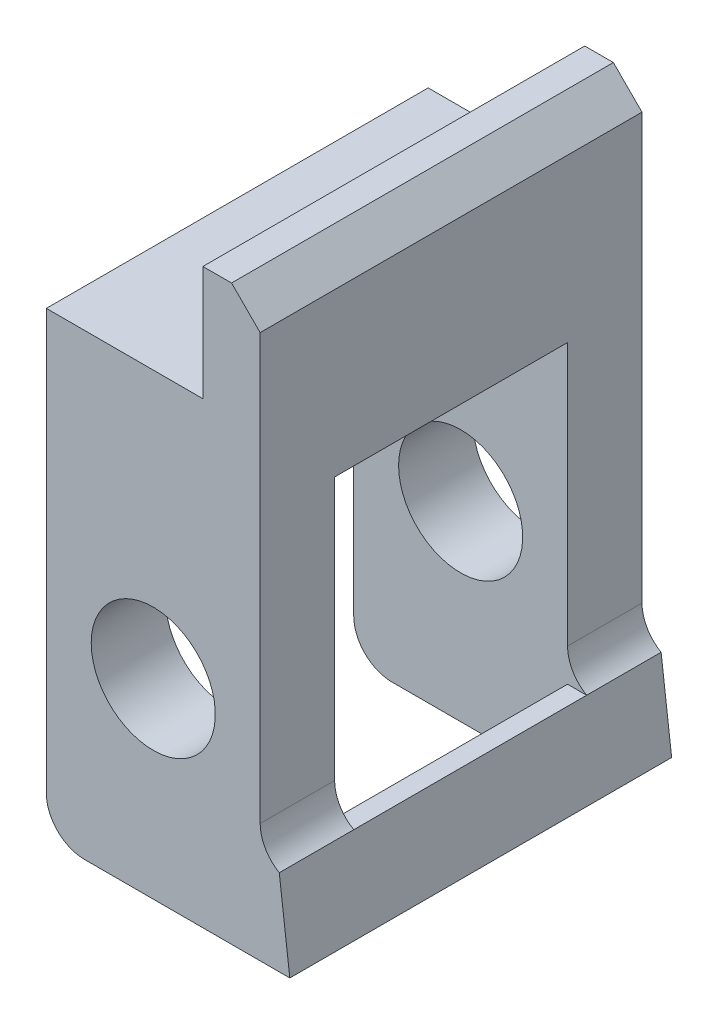
ISO-10303-21;
HEADER;
FILE_DESCRIPTION(('STEP AP214'),'2;1');
FILE_NAME('part.step','',(''),(''),'','','');
FILE_SCHEMA(('AUTOMOTIVE_DESIGN { 1 0 10303 214 1 1 1 1 }'));
ENDSEC;
DATA;
#1=APPLICATION_CONTEXT('core data for automotive mechanical design processes');
#2=APPLICATION_PROTOCOL_DEFINITION('international standard','automotive_design',2000,#1);
#3=PRODUCT_CONTEXT('',#1,'mechanical');
#4=PRODUCT('Part','Part','',(#3));
#5=PRODUCT_RELATED_PRODUCT_CATEGORY('part','',(#4));
#6=PRODUCT_DEFINITION_FORMATION('','',#4);
#7=PRODUCT_DEFINITION_CONTEXT('part definition',#1,'design');
#8=PRODUCT_DEFINITION('design','',#6,#7);
#9=PRODUCT_DEFINITION_SHAPE('','',#8);
#10=(LENGTH_UNIT() NAMED_UNIT(*) SI_UNIT(.MILLI.,.METRE.));
#11=(NAMED_UNIT(*) PLANE_ANGLE_UNIT() SI_UNIT($,.RADIAN.));
#12=(NAMED_UNIT(*) SI_UNIT($,.STERADIAN.) SOLID_ANGLE_UNIT());
#13=UNCERTAINTY_MEASURE_WITH_UNIT(LENGTH_MEASURE(1.E-05),#10,'distance_accuracy_value','');
#14=(GEOMETRIC_REPRESENTATION_CONTEXT(3) GLOBAL_UNCERTAINTY_ASSIGNED_CONTEXT((#13)) GLOBAL_UNIT_ASSIGNED_CONTEXT((#10,
#11,#12)) REPRESENTATION_CONTEXT('',''));
#15=CARTESIAN_POINT('',(0.,0.,0.));
#16=DIRECTION('',(0.,0.,1.));
#17=DIRECTION('',(1.,0.,0.));
#18=AXIS2_PLACEMENT_3D('',#15,#16,#17);
#19=CARTESIAN_POINT('',(11.684,5.71500000000001,32.6812626722529));
#20=DIRECTION('',(0.,1.,0.));
#21=DIRECTION('',(-1.,0.,0.));
#22=AXIS2_PLACEMENT_3D('',#19,#20,#21);
#23=PLANE('',#22);
#24=DIRECTION('',(1.,0.,0.));
#25=VECTOR('',#24,1.);
#26=CARTESIAN_POINT('',(25.4,5.71499999999999,4.953));
#27=LINE('',#26,#25);
#28=CARTESIAN_POINT('',(14.224,5.71500000000001,4.953));
#29=VERTEX_POINT('',#28);
#30=CARTESIAN_POINT('',(15.494,5.715,4.953));
#31=VERTEX_POINT('',#30);
#32=EDGE_CURVE('E55',#29,#31,#27,.T.);
#33=ORIENTED_EDGE('',*,*,#32,.F.);
#34=DIRECTION('',(0.,0.,-1.));
#35=VECTOR('',#34,1.);
#36=CARTESIAN_POINT('',(14.224,5.71500000000001,27.0173830282429));
#37=LINE('',#36,#35);
#38=CARTESIAN_POINT('',(14.224,5.71500000000001,20.447));
#39=VERTEX_POINT('',#38);
#40=EDGE_CURVE('E297',#39,#29,#37,.T.);
#41=ORIENTED_EDGE('',*,*,#40,.F.);
#42=DIRECTION('',(-1.,0.,0.));
#43=VECTOR('',#42,1.);
#44=CARTESIAN_POINT('',(25.4,5.71499999999999,20.447));
#45=LINE('',#44,#43);
#46=CARTESIAN_POINT('',(15.494,5.715,20.447));
#47=VERTEX_POINT('',#46);
#48=EDGE_CURVE('E63',#47,#39,#45,.T.);
#49=ORIENTED_EDGE('',*,*,#48,.F.);
#50=DIRECTION('',(0.,0.,-1.));
#51=VECTOR('',#50,1.);
#52=CARTESIAN_POINT('',(15.494,5.715,32.6812626722529));
#53=LINE('',#52,#51);
#54=EDGE_CURVE('E283',#47,#31,#53,.T.);
#55=ORIENTED_EDGE('',*,*,#54,.T.);
#56=EDGE_LOOP('',(#33,#41,#49,#55));
#57=FACE_BOUND('',#56,.T.);
#58=ADVANCED_FACE('F41',(#57),#23,.T.);
#59=CARTESIAN_POINT('',(2.54,2.54,25.4));
#60=DIRECTION('',(0.,0.,-1.));
#61=DIRECTION('',(-1.,0.,0.));
#62=AXIS2_PLACEMENT_3D('',#59,#60,#61);
#63=CYLINDRICAL_SURFACE('',#62,2.54);
#64=CARTESIAN_POINT('',(2.54,2.54,4.953));
#65=DIRECTION('',(0.,0.,-1.));
#66=DIRECTION('',(0.,1.,0.));
#67=AXIS2_PLACEMENT_3D('',#64,#65,#66);
#68=CIRCLE('',#67,2.54);
#69=CARTESIAN_POINT('',(0.,2.54,4.953));
#70=VERTEX_POINT('',#69);
#71=CARTESIAN_POINT('',(2.54,0.,4.953));
#72=VERTEX_POINT('',#71);
#73=EDGE_CURVE('E327',#70,#72,#68,.F.);
#74=ORIENTED_EDGE('',*,*,#73,.F.);
#75=DIRECTION('',(0.,0.,-1.));
#76=VECTOR('',#75,1.);
#77=CARTESIAN_POINT('',(0.,2.54,25.4));
#78=LINE('',#77,#76);
#79=CARTESIAN_POINT('',(0.,2.54,0.));
#80=VERTEX_POINT('',#79);
#81=EDGE_CURVE('E222',#80,#70,#78,.F.);
#82=ORIENTED_EDGE('',*,*,#81,.F.);
#83=CARTESIAN_POINT('',(2.54,2.54,0.));
#84=DIRECTION('',(0.,0.,-1.));
#85=DIRECTION('',(-1.,0.,0.));
#86=AXIS2_PLACEMENT_3D('',#83,#84,#85);
#87=CIRCLE('',#86,2.54);
#88=CARTESIAN_POINT('',(2.54,0.,0.));
#89=VERTEX_POINT('',#88);
#90=EDGE_CURVE('E219',#89,#80,#87,.T.);
#91=ORIENTED_EDGE('',*,*,#90,.F.);
#92=DIRECTION('',(0.,0.,-1.));
#93=VECTOR('',#92,1.);
#94=CARTESIAN_POINT('',(2.54,0.,25.4));
#95=LINE('',#94,#93);
#96=EDGE_CURVE('E215',#72,#89,#95,.T.);
#97=ORIENTED_EDGE('',*,*,#96,.F.);
#98=EDGE_LOOP('',(#74,#82,#91,#97));
#99=FACE_BOUND('',#98,.T.);
#100=ADVANCED_FACE('F354',(#99),#63,.T.);
#101=CARTESIAN_POINT('',(7.112,12.7,25.4));
#102=DIRECTION('',(0.,0.,-1.));
#103=DIRECTION('',(-1.,0.,0.));
#104=AXIS2_PLACEMENT_3D('',#101,#102,#103);
#105=CYLINDRICAL_SURFACE('',#104,4.1275);
#106=CARTESIAN_POINT('',(7.112,12.7,4.953));
#107=DIRECTION('',(0.,0.,-1.));
#108=DIRECTION('',(0.,1.,0.));
#109=AXIS2_PLACEMENT_3D('',#106,#107,#108);
#110=CIRCLE('',#109,4.1275);
#111=CARTESIAN_POINT('',(7.112,16.8275,4.953));
#112=VERTEX_POINT('',#111);
#113=EDGE_CURVE('E236',#112,#112,#110,.F.);
#114=ORIENTED_EDGE('',*,*,#113,.T.);
#115=EDGE_LOOP('',(#114));
#116=FACE_BOUND('',#115,.T.);
#117=CARTESIAN_POINT('',(7.112,12.7,0.));
#118=DIRECTION('',(0.,0.,-1.));
#119=DIRECTION('',(-1.,0.,0.));
#120=AXIS2_PLACEMENT_3D('',#117,#118,#119);
#121=CIRCLE('',#120,4.1275);
#122=CARTESIAN_POINT('',(2.9845,12.7,0.));
#123=VERTEX_POINT('',#122);
#124=EDGE_CURVE('E203',#123,#123,#121,.T.);
#125=ORIENTED_EDGE('',*,*,#124,.T.);
#126=EDGE_LOOP('',(#125));
#127=FACE_BOUND('',#126,.T.);
#128=ADVANCED_FACE('F389',(#116,#127),#105,.F.);
#129=CARTESIAN_POINT('',(14.224,0.,25.4));
#130=DIRECTION('',(0.,1.,0.));
#131=DIRECTION('',(-1.,0.,0.));
#132=AXIS2_PLACEMENT_3D('',#129,#130,#131);
#133=PLANE('',#132);
#134=DIRECTION('',(0.,0.,-1.));
#135=VECTOR('',#134,1.);
#136=CARTESIAN_POINT('',(14.9257137655601,0.,27.0173830282429));
#137=LINE('',#136,#135);
#138=CARTESIAN_POINT('',(14.9257137655601,0.,20.447));
#139=VERTEX_POINT('',#138);
#140=CARTESIAN_POINT('',(14.9257137655601,0.,4.953));
#141=VERTEX_POINT('',#140);
#142=EDGE_CURVE('E187',#139,#141,#137,.T.);
#143=ORIENTED_EDGE('',*,*,#142,.T.);
#144=DIRECTION('',(-1.,0.,0.));
#145=VECTOR('',#144,1.);
#146=CARTESIAN_POINT('',(25.4,0.,4.953));
#147=LINE('',#146,#145);
#148=EDGE_CURVE('E304',#141,#72,#147,.T.);
#149=ORIENTED_EDGE('',*,*,#148,.T.);
#150=ORIENTED_EDGE('',*,*,#96,.T.);
#151=DIRECTION('',(1.,0.,0.));
#152=VECTOR('',#151,1.);
#153=CARTESIAN_POINT('',(14.224,0.,0.));
#154=LINE('',#153,#152);
#155=CARTESIAN_POINT('',(16.1957137655601,0.,0.));
#156=VERTEX_POINT('',#155);
#157=EDGE_CURVE('E200',#89,#156,#154,.T.);
#158=ORIENTED_EDGE('',*,*,#157,.T.);
#159=DIRECTION('',(0.,0.,-1.));
#160=VECTOR('',#159,1.);
#161=CARTESIAN_POINT('',(16.1957137655601,0.,32.6812626722529));
#162=LINE('',#161,#160);
#163=CARTESIAN_POINT('',(16.1957137655601,0.,25.4));
#164=VERTEX_POINT('',#163);
#165=EDGE_CURVE('E279',#164,#156,#162,.T.);
#166=ORIENTED_EDGE('',*,*,#165,.F.);
#167=DIRECTION('',(1.,0.,0.));
#168=VECTOR('',#167,1.);
#169=CARTESIAN_POINT('',(14.224,0.,25.4));
#170=LINE('',#169,#168);
#171=CARTESIAN_POINT('',(2.54,0.,25.4));
#172=VERTEX_POINT('',#171);
#173=EDGE_CURVE('E211',#172,#164,#170,.T.);
#174=ORIENTED_EDGE('',*,*,#173,.F.);
#175=CARTESIAN_POINT('',(2.54,0.,20.447));
#176=VERTEX_POINT('',#175);
#177=EDGE_CURVE('E216',#172,#176,#95,.T.);
#178=ORIENTED_EDGE('',*,*,#177,.T.);
#179=DIRECTION('',(-1.,0.,0.));
#180=VECTOR('',#179,1.);
#181=CARTESIAN_POINT('',(25.4,0.,20.447));
#182=LINE('',#181,#180);
#183=EDGE_CURVE('E320',#139,#176,#182,.T.);
#184=ORIENTED_EDGE('',*,*,#183,.F.);
#185=EDGE_LOOP('',(#143,#149,#150,#158,#166,#174,#178,#184));
#186=FACE_BOUND('',#185,.T.);
#187=ADVANCED_FACE('F357',(#186),#133,.F.);
#188=CARTESIAN_POINT('',(14.224,38.1,25.4));
#189=DIRECTION('',(-1.,0.,0.));
#190=DIRECTION('',(0.,-1.,0.));
#191=AXIS2_PLACEMENT_3D('',#188,#189,#190);
#192=PLANE('',#191);
#193=DIRECTION('',(0.,1.,0.));
#194=VECTOR('',#193,1.);
#195=CARTESIAN_POINT('',(14.224,38.1,25.4));
#196=LINE('',#195,#194);
#197=CARTESIAN_POINT('',(14.224,7.91470452561248,25.4));
#198=VERTEX_POINT('',#197);
#199=CARTESIAN_POINT('',(14.224,36.195,25.4));
#200=VERTEX_POINT('',#199);
#201=EDGE_CURVE('E335',#198,#200,#196,.T.);
#202=ORIENTED_EDGE('',*,*,#201,.F.);
#203=DIRECTION('',(0.,0.,-1.));
#204=VECTOR('',#203,1.);
#205=CARTESIAN_POINT('',(14.224,7.91470452561247,25.4));
#206=LINE('',#205,#204);
#207=CARTESIAN_POINT('',(14.224,7.91470452561247,20.447));
#208=VERTEX_POINT('',#207);
#209=EDGE_CURVE('E255',#198,#208,#206,.T.);
#210=ORIENTED_EDGE('',*,*,#209,.T.);
#211=DIRECTION('',(0.,1.,0.));
#212=VECTOR('',#211,1.);
#213=CARTESIAN_POINT('',(14.224,38.1,20.447));
#214=LINE('',#213,#212);
#215=CARTESIAN_POINT('',(14.224,25.4,20.447));
#216=VERTEX_POINT('',#215);
#217=EDGE_CURVE('E234',#208,#216,#214,.T.);
#218=ORIENTED_EDGE('',*,*,#217,.T.);
#219=DIRECTION('',(0.,0.,-1.));
#220=VECTOR('',#219,1.);
#221=CARTESIAN_POINT('',(14.224,25.4,25.4));
#222=LINE('',#221,#220);
#223=CARTESIAN_POINT('',(14.224,25.4,4.953));
#224=VERTEX_POINT('',#223);
#225=EDGE_CURVE('E329',#216,#224,#222,.T.);
#226=ORIENTED_EDGE('',*,*,#225,.T.);
#227=DIRECTION('',(0.,-1.,0.));
#228=VECTOR('',#227,1.);
#229=CARTESIAN_POINT('',(14.224,38.1,4.953));
#230=LINE('',#229,#228);
#231=CARTESIAN_POINT('',(14.224,7.91470452561247,4.953));
#232=VERTEX_POINT('',#231);
#233=EDGE_CURVE('E239',#224,#232,#230,.T.);
#234=ORIENTED_EDGE('',*,*,#233,.T.);
#235=DIRECTION('',(0.,0.,-1.));
#236=VECTOR('',#235,1.);
#237=CARTESIAN_POINT('',(14.224,7.91470452561247,25.4));
#238=LINE('',#237,#236);
#239=CARTESIAN_POINT('',(14.224,7.91470452561248,0.));
#240=VERTEX_POINT('',#239);
#241=EDGE_CURVE('E252',#232,#240,#238,.T.);
#242=ORIENTED_EDGE('',*,*,#241,.T.);
#243=DIRECTION('',(0.,1.,0.));
#244=VECTOR('',#243,1.);
#245=CARTESIAN_POINT('',(14.224,38.1,0.));
#246=LINE('',#245,#244);
#247=CARTESIAN_POINT('',(14.224,36.195,0.));
#248=VERTEX_POINT('',#247);
#249=EDGE_CURVE('E202',#240,#248,#246,.T.);
#250=ORIENTED_EDGE('',*,*,#249,.T.);
#251=DIRECTION('',(0.,0.,1.));
#252=VECTOR('',#251,1.);
#253=CARTESIAN_POINT('',(14.224,36.195,25.4));
#254=LINE('',#253,#252);
#255=EDGE_CURVE('E248',#248,#200,#254,.T.);
#256=ORIENTED_EDGE('',*,*,#255,.T.);
#257=EDGE_LOOP('',(#202,#210,#218,#226,#234,#242,#250,#256));
#258=FACE_BOUND('',#257,.T.);
#259=ADVANCED_FACE('F370',(#258),#192,.F.);
#260=CARTESIAN_POINT('',(10.414,38.1,25.4));
#261=DIRECTION('',(0.,-1.,0.));
#262=DIRECTION('',(0.,0.,-1.));
#263=AXIS2_PLACEMENT_3D('',#260,#261,#262);
#264=PLANE('',#263);
#265=DIRECTION('',(-1.,0.,0.));
#266=VECTOR('',#265,1.);
#267=CARTESIAN_POINT('',(10.414,38.1,25.4));
#268=LINE('',#267,#266);
#269=CARTESIAN_POINT('',(12.319,38.1,25.4));
#270=VERTEX_POINT('',#269);
#271=CARTESIAN_POINT('',(10.414,38.1,25.4));
#272=VERTEX_POINT('',#271);
#273=EDGE_CURVE('E337',#270,#272,#268,.T.);
#274=ORIENTED_EDGE('',*,*,#273,.F.);
#275=DIRECTION('',(0.,0.,-1.));
#276=VECTOR('',#275,1.);
#277=CARTESIAN_POINT('',(12.319,38.1,25.4));
#278=LINE('',#277,#276);
#279=CARTESIAN_POINT('',(12.319,38.1,0.));
#280=VERTEX_POINT('',#279);
#281=EDGE_CURVE('E245',#270,#280,#278,.T.);
#282=ORIENTED_EDGE('',*,*,#281,.T.);
#283=DIRECTION('',(-1.,0.,0.));
#284=VECTOR('',#283,1.);
#285=CARTESIAN_POINT('',(10.414,38.1,0.));
#286=LINE('',#285,#284);
#287=CARTESIAN_POINT('',(10.414,38.1,0.));
#288=VERTEX_POINT('',#287);
#289=EDGE_CURVE('E205',#280,#288,#286,.T.);
#290=ORIENTED_EDGE('',*,*,#289,.T.);
#291=DIRECTION('',(0.,0.,-1.));
#292=VECTOR('',#291,1.);
#293=CARTESIAN_POINT('',(10.414,38.1,25.4));
#294=LINE('',#293,#292);
#295=EDGE_CURVE('E196',#272,#288,#294,.T.);
#296=ORIENTED_EDGE('',*,*,#295,.F.);
#297=EDGE_LOOP('',(#274,#282,#290,#296));
#298=FACE_BOUND('',#297,.T.);
#299=ADVANCED_FACE('F343',(#298),#264,.F.);
#300=CARTESIAN_POINT('',(10.414,30.48,25.4));
#301=DIRECTION('',(1.,0.,0.));
#302=DIRECTION('',(0.,1.,0.));
#303=AXIS2_PLACEMENT_3D('',#300,#301,#302);
#304=PLANE('',#303);
#305=DIRECTION('',(0.,-1.,0.));
#306=VECTOR('',#305,1.);
#307=CARTESIAN_POINT('',(10.414,30.48,0.));
#308=LINE('',#307,#306);
#309=CARTESIAN_POINT('',(10.414,30.48,0.));
#310=VERTEX_POINT('',#309);
#311=EDGE_CURVE('E207',#288,#310,#308,.T.);
#312=ORIENTED_EDGE('',*,*,#311,.T.);
#313=DIRECTION('',(0.,0.,-1.));
#314=VECTOR('',#313,1.);
#315=CARTESIAN_POINT('',(10.414,30.48,25.4));
#316=LINE('',#315,#314);
#317=CARTESIAN_POINT('',(10.414,30.48,25.4));
#318=VERTEX_POINT('',#317);
#319=EDGE_CURVE('E194',#318,#310,#316,.T.);
#320=ORIENTED_EDGE('',*,*,#319,.F.);
#321=DIRECTION('',(0.,-1.,0.));
#322=VECTOR('',#321,1.);
#323=CARTESIAN_POINT('',(10.414,30.48,25.4));
#324=LINE('',#323,#322);
#325=EDGE_CURVE('E175',#272,#318,#324,.T.);
#326=ORIENTED_EDGE('',*,*,#325,.F.);
#327=ORIENTED_EDGE('',*,*,#295,.T.);
#328=EDGE_LOOP('',(#312,#320,#326,#327));
#329=FACE_BOUND('',#328,.T.);
#330=ADVANCED_FACE('F347',(#329),#304,.F.);
#331=CARTESIAN_POINT('',(3.81,30.48,25.4));
#332=DIRECTION('',(0.,-1.,0.));
#333=DIRECTION('',(0.,0.,-1.));
#334=AXIS2_PLACEMENT_3D('',#331,#332,#333);
#335=PLANE('',#334);
#336=DIRECTION('',(-1.,0.,0.));
#337=VECTOR('',#336,1.);
#338=CARTESIAN_POINT('',(3.81,30.48,0.));
#339=LINE('',#338,#337);
#340=CARTESIAN_POINT('',(0.,30.48,0.));
#341=VERTEX_POINT('',#340);
#342=EDGE_CURVE('E184',#310,#341,#339,.T.);
#343=ORIENTED_EDGE('',*,*,#342,.T.);
#344=DIRECTION('',(0.,0.,-1.));
#345=VECTOR('',#344,1.);
#346=CARTESIAN_POINT('',(0.,30.48,25.4));
#347=LINE('',#346,#345);
#348=CARTESIAN_POINT('',(0.,30.48,25.4));
#349=VERTEX_POINT('',#348);
#350=EDGE_CURVE('E181',#349,#341,#347,.T.);
#351=ORIENTED_EDGE('',*,*,#350,.F.);
#352=DIRECTION('',(-1.,0.,0.));
#353=VECTOR('',#352,1.);
#354=CARTESIAN_POINT('',(3.81,30.48,25.4));
#355=LINE('',#354,#353);
#356=EDGE_CURVE('E167',#318,#349,#355,.T.);
#357=ORIENTED_EDGE('',*,*,#356,.F.);
#358=ORIENTED_EDGE('',*,*,#319,.T.);
#359=EDGE_LOOP('',(#343,#351,#357,#358));
#360=FACE_BOUND('',#359,.T.);
#361=ADVANCED_FACE('F182',(#360),#335,.F.);
#362=CARTESIAN_POINT('',(0.,0.,25.4));
#363=DIRECTION('',(1.,0.,0.));
#364=DIRECTION('',(0.,0.,-1.));
#365=AXIS2_PLACEMENT_3D('',#362,#363,#364);
#366=PLANE('',#365);
#367=DIRECTION('',(0.,-1.,0.));
#368=VECTOR('',#367,1.);
#369=CARTESIAN_POINT('',(0.,0.,25.4));
#370=LINE('',#369,#368);
#371=CARTESIAN_POINT('',(0.,2.54,25.4));
#372=VERTEX_POINT('',#371);
#373=EDGE_CURVE('E172',#349,#372,#370,.T.);
#374=ORIENTED_EDGE('',*,*,#373,.F.);
#375=ORIENTED_EDGE('',*,*,#350,.T.);
#376=DIRECTION('',(0.,-1.,0.));
#377=VECTOR('',#376,1.);
#378=CARTESIAN_POINT('',(0.,0.,0.));
#379=LINE('',#378,#377);
#380=EDGE_CURVE('E210',#341,#80,#379,.T.);
#381=ORIENTED_EDGE('',*,*,#380,.T.);
#382=ORIENTED_EDGE('',*,*,#81,.T.);
#383=DIRECTION('',(0.,-1.,0.));
#384=VECTOR('',#383,1.);
#385=CARTESIAN_POINT('',(0.,0.,4.953));
#386=LINE('',#385,#384);
#387=CARTESIAN_POINT('',(0.,25.4,4.953));
#388=VERTEX_POINT('',#387);
#389=EDGE_CURVE('E307',#388,#70,#386,.T.);
#390=ORIENTED_EDGE('',*,*,#389,.F.);
#391=DIRECTION('',(0.,0.,-1.));
#392=VECTOR('',#391,1.);
#393=CARTESIAN_POINT('',(0.,25.4,4.953));
#394=LINE('',#393,#392);
#395=CARTESIAN_POINT('',(0.,25.4,20.447));
#396=VERTEX_POINT('',#395);
#397=EDGE_CURVE('E314',#396,#388,#394,.T.);
#398=ORIENTED_EDGE('',*,*,#397,.F.);
#399=DIRECTION('',(0.,1.,0.));
#400=VECTOR('',#399,1.);
#401=CARTESIAN_POINT('',(0.,0.,20.447));
#402=LINE('',#401,#400);
#403=CARTESIAN_POINT('',(0.,2.54,20.447));
#404=VERTEX_POINT('',#403);
#405=EDGE_CURVE('E309',#404,#396,#402,.T.);
#406=ORIENTED_EDGE('',*,*,#405,.F.);
#407=EDGE_CURVE('E192',#404,#372,#78,.F.);
#408=ORIENTED_EDGE('',*,*,#407,.T.);
#409=EDGE_LOOP('',(#374,#375,#381,#382,#390,#398,#406,#408));
#410=FACE_BOUND('',#409,.T.);
#411=ADVANCED_FACE('F189',(#410),#366,.F.);
#412=CARTESIAN_POINT('',(0.,0.,25.4));
#413=DIRECTION('',(0.,0.,-1.));
#414=DIRECTION('',(-1.,0.,0.));
#415=AXIS2_PLACEMENT_3D('',#412,#413,#414);
#416=PLANE('',#415);
#417=ORIENTED_EDGE('',*,*,#356,.T.);
#418=ORIENTED_EDGE('',*,*,#373,.T.);
#419=CARTESIAN_POINT('',(2.54,2.54,25.4));
#420=DIRECTION('',(0.,0.,-1.));
#421=DIRECTION('',(-1.,0.,0.));
#422=AXIS2_PLACEMENT_3D('',#419,#420,#421);
#423=CIRCLE('',#422,2.54);
#424=EDGE_CURVE('E225',#372,#172,#423,.F.);
#425=ORIENTED_EDGE('',*,*,#424,.T.);
#426=ORIENTED_EDGE('',*,*,#173,.T.);
#427=DIRECTION('',(-0.121869343405141,0.992546151641323,0.));
#428=VECTOR('',#427,1.);
#429=CARTESIAN_POINT('',(15.494,5.715,25.4));
#430=LINE('',#429,#428);
#431=CARTESIAN_POINT('',(15.494,5.715,25.4));
#432=VERTEX_POINT('',#431);
#433=EDGE_CURVE('E292',#164,#432,#430,.T.);
#434=ORIENTED_EDGE('',*,*,#433,.T.);
#435=CARTESIAN_POINT('',(16.764,7.91470452561247,25.4));
#436=DIRECTION('',(0.,0.,-1.));
#437=DIRECTION('',(-1.,0.,0.));
#438=AXIS2_PLACEMENT_3D('',#435,#436,#437);
#439=CIRCLE('',#438,2.54);
#440=EDGE_CURVE('E260',#432,#198,#439,.T.);
#441=ORIENTED_EDGE('',*,*,#440,.T.);
#442=ORIENTED_EDGE('',*,*,#201,.T.);
#443=DIRECTION('',(0.707106781186545,-0.70710678118655,0.));
#444=VECTOR('',#443,1.);
#445=CARTESIAN_POINT('',(12.319,38.1,25.4));
#446=LINE('',#445,#444);
#447=EDGE_CURVE('E243',#200,#270,#446,.F.);
#448=ORIENTED_EDGE('',*,*,#447,.T.);
#449=ORIENTED_EDGE('',*,*,#273,.T.);
#450=ORIENTED_EDGE('',*,*,#325,.T.);
#451=EDGE_LOOP('',(#417,#418,#425,#426,#434,#441,#442,#448,#449,#450));
#452=FACE_BOUND('',#451,.T.);
#453=CARTESIAN_POINT('',(7.112,12.7,25.4));
#454=DIRECTION('',(0.,0.,-1.));
#455=DIRECTION('',(-1.,0.,0.));
#456=AXIS2_PLACEMENT_3D('',#453,#454,#455);
#457=CIRCLE('',#456,4.1275);
#458=CARTESIAN_POINT('',(2.9845,12.7,25.4));
#459=VERTEX_POINT('',#458);
#460=EDGE_CURVE('E230',#459,#459,#457,.T.);
#461=ORIENTED_EDGE('',*,*,#460,.T.);
#462=EDGE_LOOP('',(#461));
#463=FACE_BOUND('',#462,.T.);
#464=ADVANCED_FACE('F169',(#452,#463),#416,.F.);
#465=CARTESIAN_POINT('',(0.,0.,0.));
#466=DIRECTION('',(0.,0.,-1.));
#467=DIRECTION('',(-1.,0.,0.));
#468=AXIS2_PLACEMENT_3D('',#465,#466,#467);
#469=PLANE('',#468);
#470=ORIENTED_EDGE('',*,*,#380,.F.);
#471=ORIENTED_EDGE('',*,*,#342,.F.);
#472=ORIENTED_EDGE('',*,*,#311,.F.);
#473=ORIENTED_EDGE('',*,*,#289,.F.);
#474=DIRECTION('',(-0.707106781186545,0.70710678118655,0.));
#475=VECTOR('',#474,1.);
#476=CARTESIAN_POINT('',(25.2095,25.2094999999999,0.));
#477=LINE('',#476,#475);
#478=EDGE_CURVE('E227',#280,#248,#477,.F.);
#479=ORIENTED_EDGE('',*,*,#478,.T.);
#480=ORIENTED_EDGE('',*,*,#249,.F.);
#481=CARTESIAN_POINT('',(16.764,7.91470452561247,0.));
#482=DIRECTION('',(0.,0.,-1.));
#483=DIRECTION('',(-1.,0.,0.));
#484=AXIS2_PLACEMENT_3D('',#481,#482,#483);
#485=CIRCLE('',#484,2.54);
#486=CARTESIAN_POINT('',(15.494,5.715,0.));
#487=VERTEX_POINT('',#486);
#488=EDGE_CURVE('E49',#240,#487,#485,.F.);
#489=ORIENTED_EDGE('',*,*,#488,.T.);
#490=DIRECTION('',(0.121869343405141,-0.992546151641323,0.));
#491=VECTOR('',#490,1.);
#492=CARTESIAN_POINT('',(15.494,5.715,0.));
#493=LINE('',#492,#491);
#494=EDGE_CURVE('E268',#487,#156,#493,.T.);
#495=ORIENTED_EDGE('',*,*,#494,.T.);
#496=ORIENTED_EDGE('',*,*,#157,.F.);
#497=ORIENTED_EDGE('',*,*,#90,.T.);
#498=EDGE_LOOP('',(#470,#471,#472,#473,#479,#480,#489,#495,#496,#497));
#499=FACE_BOUND('',#498,.T.);
#500=ORIENTED_EDGE('',*,*,#124,.F.);
#501=EDGE_LOOP('',(#500));
#502=FACE_BOUND('',#501,.T.);
#503=ADVANCED_FACE('F265',(#499,#502),#469,.T.);
#504=CARTESIAN_POINT('',(2.54,2.54,20.447));
#505=DIRECTION('',(0.,0.,1.));
#506=DIRECTION('',(0.,-1.,0.));
#507=AXIS2_PLACEMENT_3D('',#504,#505,#506);
#508=CIRCLE('',#507,2.54);
#509=EDGE_CURVE('E240',#176,#404,#508,.F.);
#510=ORIENTED_EDGE('',*,*,#509,.F.);
#511=ORIENTED_EDGE('',*,*,#177,.F.);
#512=ORIENTED_EDGE('',*,*,#424,.F.);
#513=ORIENTED_EDGE('',*,*,#407,.F.);
#514=EDGE_LOOP('',(#510,#511,#512,#513));
#515=FACE_BOUND('',#514,.T.);
#516=ADVANCED_FACE('F390',(#515),#63,.T.);
#517=CARTESIAN_POINT('',(7.112,12.7,20.447));
#518=DIRECTION('',(0.,0.,1.));
#519=DIRECTION('',(0.,-1.,0.));
#520=AXIS2_PLACEMENT_3D('',#517,#518,#519);
#521=CIRCLE('',#520,4.1275);
#522=CARTESIAN_POINT('',(7.112,8.5725,20.447));
#523=VERTEX_POINT('',#522);
#524=EDGE_CURVE('E231',#523,#523,#521,.F.);
#525=ORIENTED_EDGE('',*,*,#524,.T.);
#526=EDGE_LOOP('',(#525));
#527=FACE_BOUND('',#526,.T.);
#528=ORIENTED_EDGE('',*,*,#460,.F.);
#529=EDGE_LOOP('',(#528));
#530=FACE_BOUND('',#529,.T.);
#531=ADVANCED_FACE('F395',(#527,#530),#105,.F.);
#532=CARTESIAN_POINT('',(25.4,25.4,4.953));
#533=DIRECTION('',(0.,1.,0.));
#534=DIRECTION('',(-1.,0.,0.));
#535=AXIS2_PLACEMENT_3D('',#532,#533,#534);
#536=PLANE('',#535);
#537=DIRECTION('',(-1.,0.,0.));
#538=VECTOR('',#537,1.);
#539=CARTESIAN_POINT('',(25.4,25.4,20.447));
#540=LINE('',#539,#538);
#541=EDGE_CURVE('E318',#216,#396,#540,.T.);
#542=ORIENTED_EDGE('',*,*,#541,.T.);
#543=ORIENTED_EDGE('',*,*,#397,.T.);
#544=DIRECTION('',(-1.,0.,0.));
#545=VECTOR('',#544,1.);
#546=CARTESIAN_POINT('',(25.4,25.4,4.953));
#547=LINE('',#546,#545);
#548=EDGE_CURVE('E235',#224,#388,#547,.T.);
#549=ORIENTED_EDGE('',*,*,#548,.F.);
#550=ORIENTED_EDGE('',*,*,#225,.F.);
#551=EDGE_LOOP('',(#542,#543,#549,#550));
#552=FACE_BOUND('',#551,.T.);
#553=ADVANCED_FACE('F393',(#552),#536,.F.);
#554=CARTESIAN_POINT('',(25.4,0.,4.953));
#555=DIRECTION('',(0.,0.,-1.));
#556=DIRECTION('',(0.,1.,0.));
#557=AXIS2_PLACEMENT_3D('',#554,#555,#556);
#558=PLANE('',#557);
#559=DIRECTION('',(-0.121869343405141,0.992546151641323,0.));
#560=VECTOR('',#559,1.);
#561=CARTESIAN_POINT('',(14.224,5.71500000000001,4.953));
#562=LINE('',#561,#560);
#563=EDGE_CURVE('E296',#141,#29,#562,.T.);
#564=ORIENTED_EDGE('',*,*,#563,.T.);
#565=ORIENTED_EDGE('',*,*,#32,.T.);
#566=CARTESIAN_POINT('',(16.764,7.91470452561247,4.953));
#567=DIRECTION('',(0.,0.,-1.));
#568=DIRECTION('',(0.,1.,0.));
#569=AXIS2_PLACEMENT_3D('',#566,#567,#568);
#570=CIRCLE('',#569,2.54);
#571=EDGE_CURVE('E11',#31,#232,#570,.T.);
#572=ORIENTED_EDGE('',*,*,#571,.T.);
#573=ORIENTED_EDGE('',*,*,#233,.F.);
#574=ORIENTED_EDGE('',*,*,#548,.T.);
#575=ORIENTED_EDGE('',*,*,#389,.T.);
#576=ORIENTED_EDGE('',*,*,#73,.T.);
#577=ORIENTED_EDGE('',*,*,#148,.F.);
#578=EDGE_LOOP('',(#564,#565,#572,#573,#574,#575,#576,#577));
#579=FACE_BOUND('',#578,.T.);
#580=ORIENTED_EDGE('',*,*,#113,.F.);
#581=EDGE_LOOP('',(#580));
#582=FACE_BOUND('',#581,.T.);
#583=ADVANCED_FACE('F301',(#579,#582),#558,.F.);
#584=CARTESIAN_POINT('',(25.4,0.,20.447));
#585=DIRECTION('',(0.,0.,1.));
#586=DIRECTION('',(0.,-1.,0.));
#587=AXIS2_PLACEMENT_3D('',#584,#585,#586);
#588=PLANE('',#587);
#589=ORIENTED_EDGE('',*,*,#217,.F.);
#590=CARTESIAN_POINT('',(16.764,7.91470452561247,20.447));
#591=DIRECTION('',(0.,0.,1.));
#592=DIRECTION('',(0.,-1.,0.));
#593=AXIS2_PLACEMENT_3D('',#590,#591,#592);
#594=CIRCLE('',#593,2.54);
#595=EDGE_CURVE('E258',#208,#47,#594,.T.);
#596=ORIENTED_EDGE('',*,*,#595,.T.);
#597=ORIENTED_EDGE('',*,*,#48,.T.);
#598=DIRECTION('',(-0.121869343405141,0.992546151641323,0.));
#599=VECTOR('',#598,1.);
#600=CARTESIAN_POINT('',(14.224,5.715,20.447));
#601=LINE('',#600,#599);
#602=EDGE_CURVE('E280',#139,#39,#601,.T.);
#603=ORIENTED_EDGE('',*,*,#602,.F.);
#604=ORIENTED_EDGE('',*,*,#183,.T.);
#605=ORIENTED_EDGE('',*,*,#509,.T.);
#606=ORIENTED_EDGE('',*,*,#405,.T.);
#607=ORIENTED_EDGE('',*,*,#541,.F.);
#608=EDGE_LOOP('',(#589,#596,#597,#603,#604,#605,#606,#607));
#609=FACE_BOUND('',#608,.T.);
#610=ORIENTED_EDGE('',*,*,#524,.F.);
#611=EDGE_LOOP('',(#610));
#612=FACE_BOUND('',#611,.T.);
#613=ADVANCED_FACE('F362',(#609,#612),#588,.F.);
#614=CARTESIAN_POINT('',(12.319,38.1,25.4));
#615=DIRECTION('',(-0.70710678118655,-0.707106781186545,0.));
#616=DIRECTION('',(0.,0.,-1.));
#617=AXIS2_PLACEMENT_3D('',#614,#615,#616);
#618=PLANE('',#617);
#619=ORIENTED_EDGE('',*,*,#447,.F.);
#620=ORIENTED_EDGE('',*,*,#255,.F.);
#621=ORIENTED_EDGE('',*,*,#478,.F.);
#622=ORIENTED_EDGE('',*,*,#281,.F.);
#623=EDGE_LOOP('',(#619,#620,#621,#622));
#624=FACE_BOUND('',#623,.T.);
#625=ADVANCED_FACE('F373',(#624),#618,.F.);
#626=CARTESIAN_POINT('',(15.494,5.715,32.6812626722529));
#627=DIRECTION('',(0.992546151641323,0.121869343405141,0.));
#628=DIRECTION('',(-0.121869343405141,0.992546151641323,0.));
#629=AXIS2_PLACEMENT_3D('',#626,#627,#628);
#630=PLANE('',#629);
#631=ORIENTED_EDGE('',*,*,#433,.F.);
#632=ORIENTED_EDGE('',*,*,#165,.T.);
#633=ORIENTED_EDGE('',*,*,#494,.F.);
#634=EDGE_CURVE('E277',#31,#487,#53,.T.);
#635=ORIENTED_EDGE('',*,*,#634,.F.);
#636=ORIENTED_EDGE('',*,*,#54,.F.);
#637=EDGE_CURVE('E285',#432,#47,#53,.T.);
#638=ORIENTED_EDGE('',*,*,#637,.F.);
#639=EDGE_LOOP('',(#631,#632,#633,#635,#636,#638));
#640=FACE_BOUND('',#639,.T.);
#641=ADVANCED_FACE('F275',(#640),#630,.T.);
#642=CARTESIAN_POINT('',(16.764,7.91470452561247,32.6812626722529));
#643=DIRECTION('',(0.,0.,-1.));
#644=DIRECTION('',(-1.,0.,0.));
#645=AXIS2_PLACEMENT_3D('',#642,#643,#644);
#646=CYLINDRICAL_SURFACE('',#645,2.54);
#647=ORIENTED_EDGE('',*,*,#440,.F.);
#648=ORIENTED_EDGE('',*,*,#637,.T.);
#649=ORIENTED_EDGE('',*,*,#595,.F.);
#650=ORIENTED_EDGE('',*,*,#209,.F.);
#651=EDGE_LOOP('',(#647,#648,#649,#650));
#652=FACE_BOUND('',#651,.T.);
#653=ADVANCED_FACE('F367',(#652),#646,.F.);
#654=CARTESIAN_POINT('',(16.764,7.91470452561247,32.6812626722529));
#655=DIRECTION('',(0.,0.,-1.));
#656=DIRECTION('',(-1.,0.,0.));
#657=AXIS2_PLACEMENT_3D('',#654,#655,#656);
#658=CYLINDRICAL_SURFACE('',#657,2.54);
#659=ORIENTED_EDGE('',*,*,#571,.F.);
#660=ORIENTED_EDGE('',*,*,#634,.T.);
#661=ORIENTED_EDGE('',*,*,#488,.F.);
#662=ORIENTED_EDGE('',*,*,#241,.F.);
#663=EDGE_LOOP('',(#659,#660,#661,#662));
#664=FACE_BOUND('',#663,.T.);
#665=ADVANCED_FACE('F43',(#664),#658,.F.);
#666=CARTESIAN_POINT('',(14.224,5.71500000000001,27.0173830282429));
#667=DIRECTION('',(-0.992546151641323,-0.121869343405141,0.));
#668=DIRECTION('',(0.121869343405141,-0.992546151641323,0.));
#669=AXIS2_PLACEMENT_3D('',#666,#667,#668);
#670=PLANE('',#669);
#671=ORIENTED_EDGE('',*,*,#602,.T.);
#672=ORIENTED_EDGE('',*,*,#40,.T.);
#673=ORIENTED_EDGE('',*,*,#563,.F.);
#674=ORIENTED_EDGE('',*,*,#142,.F.);
#675=EDGE_LOOP('',(#671,#672,#673,#674));
#676=FACE_BOUND('',#675,.T.);
#677=ADVANCED_FACE('F359',(#676),#670,.T.);
#678=CLOSED_SHELL('',(#58,#100,#128,#187,#259,#299,#330,#361,#411,#464,#503,#516,#531,#553,#583,
#613,#625,#641,#653,#665,#677));
#679=MANIFOLD_SOLID_BREP('B2',#678);
#680=ADVANCED_BREP_SHAPE_REPRESENTATION('',(#18,#679),#14);
#681=SHAPE_DEFINITION_REPRESENTATION(#9,#680);
ENDSEC;
END-ISO-10303-21;
